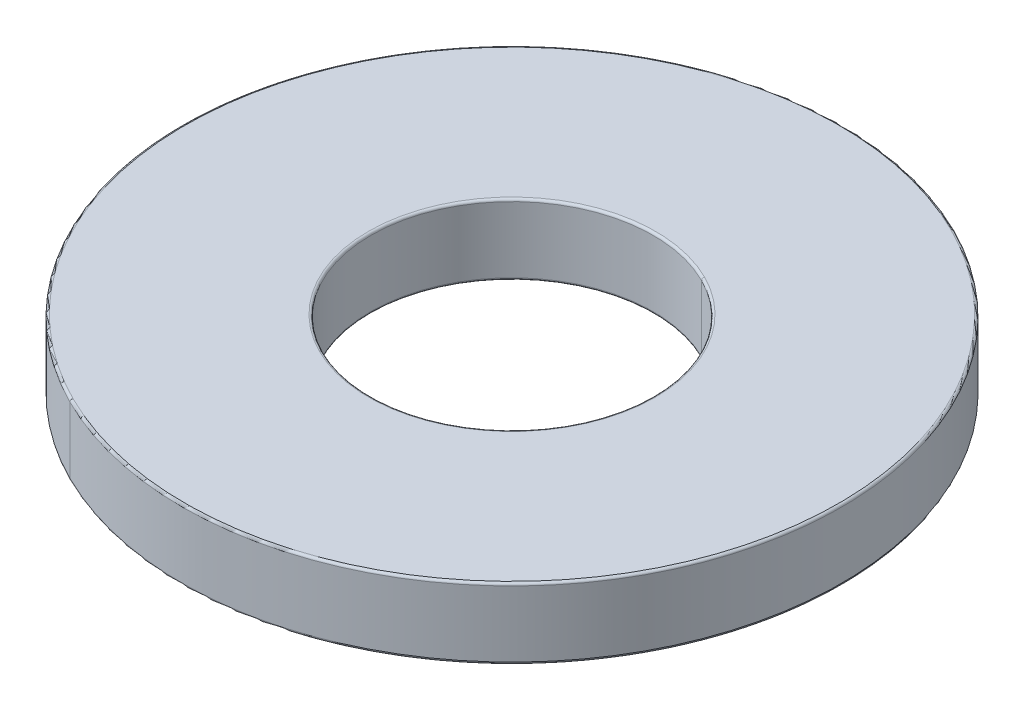
ISO-10303-21;
HEADER;
FILE_DESCRIPTION(('STEP AP214'),'2;1');
FILE_NAME('part.step','',(''),(''),'','','');
FILE_SCHEMA(('AUTOMOTIVE_DESIGN { 1 0 10303 214 1 1 1 1 }'));
ENDSEC;
DATA;
#1=APPLICATION_CONTEXT('core data for automotive mechanical design processes');
#2=APPLICATION_PROTOCOL_DEFINITION('international standard','automotive_design',2000,#1);
#3=PRODUCT_CONTEXT('',#1,'mechanical');
#4=PRODUCT('Part','Part','',(#3));
#5=PRODUCT_RELATED_PRODUCT_CATEGORY('part','',(#4));
#6=PRODUCT_DEFINITION_FORMATION('','',#4);
#7=PRODUCT_DEFINITION_CONTEXT('part definition',#1,'design');
#8=PRODUCT_DEFINITION('design','',#6,#7);
#9=PRODUCT_DEFINITION_SHAPE('','',#8);
#10=(LENGTH_UNIT() NAMED_UNIT(*) SI_UNIT(.MILLI.,.METRE.));
#11=(NAMED_UNIT(*) PLANE_ANGLE_UNIT() SI_UNIT($,.RADIAN.));
#12=(NAMED_UNIT(*) SI_UNIT($,.STERADIAN.) SOLID_ANGLE_UNIT());
#13=UNCERTAINTY_MEASURE_WITH_UNIT(LENGTH_MEASURE(1.E-05),#10,'distance_accuracy_value','');
#14=(GEOMETRIC_REPRESENTATION_CONTEXT(3) GLOBAL_UNCERTAINTY_ASSIGNED_CONTEXT((#13)) GLOBAL_UNIT_ASSIGNED_CONTEXT((#10,
#11,#12)) REPRESENTATION_CONTEXT('',''));
#15=CARTESIAN_POINT('',(0.,0.,0.));
#16=DIRECTION('',(0.,0.,1.));
#17=DIRECTION('',(1.,0.,0.));
#18=AXIS2_PLACEMENT_3D('',#15,#16,#17);
#19=CARTESIAN_POINT('',(-24.601656805203,2.61894104863,11.836193409295));
#20=DIRECTION('',(0.,-1.,0.));
#21=DIRECTION('',(-0.447273631088674,0.,0.894397170686912));
#22=AXIS2_PLACEMENT_3D('',#19,#20,#21);
#23=TOROIDAL_SURFACE('',#22,6.95,0.05);
#24=CARTESIAN_POINT('',(-21.4931050691367,2.61894104863,5.62013307302096));
#25=DIRECTION('',(-0.894397170686912,0.,-0.447273631088674));
#26=DIRECTION('',(0.447273631088674,0.,-0.894397170686912));
#27=AXIS2_PLACEMENT_3D('',#24,#25,#26);
#28=CIRCLE('',#27,0.05);
#29=CARTESIAN_POINT('',(-21.4707413875823,2.61894104863,5.57541321448662));
#30=VERTEX_POINT('',#29);
#31=CARTESIAN_POINT('',(-21.4931050691367,2.56894104863,5.62013307302096));
#32=VERTEX_POINT('',#31);
#33=EDGE_CURVE('E260',#30,#32,#28,.T.);
#34=ORIENTED_EDGE('',*,*,#33,.F.);
#35=CARTESIAN_POINT('',(-24.601656805203,2.61894104863,11.836193409295));
#36=DIRECTION('',(0.,1.,0.));
#37=DIRECTION('',(-0.447273631088674,0.,0.894397170686912));
#38=AXIS2_PLACEMENT_3D('',#35,#36,#37);
#39=CIRCLE('',#38,7.);
#40=CARTESIAN_POINT('',(-27.7325722228237,2.61894104863,18.0969736041034));
#41=VERTEX_POINT('',#40);
#42=EDGE_CURVE('E31',#41,#30,#39,.T.);
#43=ORIENTED_EDGE('',*,*,#42,.F.);
#44=CARTESIAN_POINT('',(-27.7102085412693,2.61894104863,18.052253745569));
#45=DIRECTION('',(0.894397170686912,0.,0.447273631088674));
#46=DIRECTION('',(-0.447273631088674,0.,0.894397170686912));
#47=AXIS2_PLACEMENT_3D('',#44,#45,#46);
#48=CIRCLE('',#47,0.05);
#49=CARTESIAN_POINT('',(-27.7102085412693,2.56894104863,18.052253745569));
#50=VERTEX_POINT('',#49);
#51=EDGE_CURVE('E259',#41,#50,#48,.T.);
#52=ORIENTED_EDGE('',*,*,#51,.T.);
#53=CARTESIAN_POINT('',(-24.601656805203,2.56894104863,11.836193409295));
#54=DIRECTION('',(0.,-1.,0.));
#55=DIRECTION('',(-0.447273631088674,0.,0.894397170686912));
#56=AXIS2_PLACEMENT_3D('',#53,#54,#55);
#57=CIRCLE('',#56,6.95);
#58=EDGE_CURVE('E297',#32,#50,#57,.T.);
#59=ORIENTED_EDGE('',*,*,#58,.F.);
#60=EDGE_LOOP('',(#34,#43,#52,#59));
#61=FACE_BOUND('',#60,.T.);
#62=ADVANCED_FACE('F19',(#61),#23,.T.);
#63=CARTESIAN_POINT('',(-24.601656805203,4.01894104863,11.836193409295));
#64=DIRECTION('',(0.,-1.,0.));
#65=DIRECTION('',(-0.447273631088674,0.,0.894397170686912));
#66=AXIS2_PLACEMENT_3D('',#63,#64,#65);
#67=TOROIDAL_SURFACE('',#66,6.95,0.05);
#68=CARTESIAN_POINT('',(-21.4931050691367,4.01894104863,5.62013307302096));
#69=DIRECTION('',(-0.894397170686912,0.,-0.447273631088674));
#70=DIRECTION('',(0.447273631088674,0.,-0.894397170686912));
#71=AXIS2_PLACEMENT_3D('',#68,#69,#70);
#72=CIRCLE('',#71,0.05);
#73=CARTESIAN_POINT('',(-21.4931050691367,4.06894104863,5.62013307302096));
#74=VERTEX_POINT('',#73);
#75=CARTESIAN_POINT('',(-21.4707413875823,4.01894104863,5.57541321448662));
#76=VERTEX_POINT('',#75);
#77=EDGE_CURVE('E222',#74,#76,#72,.T.);
#78=ORIENTED_EDGE('',*,*,#77,.F.);
#79=CARTESIAN_POINT('',(-24.601656805203,4.06894104863,11.836193409295));
#80=DIRECTION('',(0.,1.,0.));
#81=DIRECTION('',(-0.447273631088674,0.,0.894397170686912));
#82=AXIS2_PLACEMENT_3D('',#79,#80,#81);
#83=CIRCLE('',#82,6.95);
#84=CARTESIAN_POINT('',(-27.7102085412693,4.06894104863,18.052253745569));
#85=VERTEX_POINT('',#84);
#86=EDGE_CURVE('E283',#85,#74,#83,.T.);
#87=ORIENTED_EDGE('',*,*,#86,.F.);
#88=CARTESIAN_POINT('',(-27.7102085412693,4.01894104863,18.052253745569));
#89=DIRECTION('',(0.894397170686912,0.,0.447273631088674));
#90=DIRECTION('',(-0.447273631088674,0.,0.894397170686912));
#91=AXIS2_PLACEMENT_3D('',#88,#89,#90);
#92=CIRCLE('',#91,0.05);
#93=CARTESIAN_POINT('',(-27.7325722228237,4.01894104863,18.0969736041034));
#94=VERTEX_POINT('',#93);
#95=EDGE_CURVE('E252',#85,#94,#92,.T.);
#96=ORIENTED_EDGE('',*,*,#95,.T.);
#97=CARTESIAN_POINT('',(-24.601656805203,4.01894104863,11.836193409295));
#98=DIRECTION('',(0.,-1.,0.));
#99=DIRECTION('',(-0.447273631088674,0.,0.894397170686912));
#100=AXIS2_PLACEMENT_3D('',#97,#98,#99);
#101=CIRCLE('',#100,7.);
#102=EDGE_CURVE('E11',#76,#94,#101,.T.);
#103=ORIENTED_EDGE('',*,*,#102,.F.);
#104=EDGE_LOOP('',(#78,#87,#96,#103));
#105=FACE_BOUND('',#104,.T.);
#106=ADVANCED_FACE('F459',(#105),#67,.T.);
#107=CARTESIAN_POINT('',(-24.601656805203,2.61894104863,11.836193409295));
#108=DIRECTION('',(0.,-1.,0.));
#109=DIRECTION('',(-0.447273631088674,0.,0.894397170686912));
#110=AXIS2_PLACEMENT_3D('',#107,#108,#109);
#111=TOROIDAL_SURFACE('',#110,3.05,0.05);
#112=CARTESIAN_POINT('',(-23.2374722303825,2.61894104863,9.10828203869992));
#113=DIRECTION('',(-0.894397170686912,0.,-0.447273631088674));
#114=DIRECTION('',(0.447273631088674,0.,-0.894397170686912));
#115=AXIS2_PLACEMENT_3D('',#112,#113,#114);
#116=CIRCLE('',#115,0.05);
#117=CARTESIAN_POINT('',(-23.2374722303825,2.56894104863,9.10828203869992));
#118=VERTEX_POINT('',#117);
#119=CARTESIAN_POINT('',(-23.259835911937,2.61894104863,9.15300189723426));
#120=VERTEX_POINT('',#119);
#121=EDGE_CURVE('E251',#118,#120,#116,.T.);
#122=ORIENTED_EDGE('',*,*,#121,.F.);
#123=CARTESIAN_POINT('',(-24.601656805203,2.56894104863,11.836193409295));
#124=DIRECTION('',(0.,1.,0.));
#125=DIRECTION('',(-0.447273631088674,0.,0.894397170686912));
#126=AXIS2_PLACEMENT_3D('',#123,#124,#125);
#127=CIRCLE('',#126,3.05);
#128=CARTESIAN_POINT('',(-25.9658413800235,2.56894104863,14.5641047798901));
#129=VERTEX_POINT('',#128);
#130=EDGE_CURVE('E117',#129,#118,#127,.T.);
#131=ORIENTED_EDGE('',*,*,#130,.F.);
#132=CARTESIAN_POINT('',(-25.9658413800235,2.61894104863,14.5641047798901));
#133=DIRECTION('',(0.894397170686912,0.,0.447273631088674));
#134=DIRECTION('',(-0.447273631088674,0.,0.894397170686912));
#135=AXIS2_PLACEMENT_3D('',#132,#133,#134);
#136=CIRCLE('',#135,0.05);
#137=CARTESIAN_POINT('',(-25.943477698469,2.61894104863,14.5193849213557));
#138=VERTEX_POINT('',#137);
#139=EDGE_CURVE('E325',#129,#138,#136,.T.);
#140=ORIENTED_EDGE('',*,*,#139,.T.);
#141=CARTESIAN_POINT('',(-24.601656805203,2.61894104863,11.836193409295));
#142=DIRECTION('',(0.,-1.,0.));
#143=DIRECTION('',(-0.447273631088674,0.,0.894397170686912));
#144=AXIS2_PLACEMENT_3D('',#141,#142,#143);
#145=CIRCLE('',#144,3.);
#146=EDGE_CURVE('E154',#120,#138,#145,.T.);
#147=ORIENTED_EDGE('',*,*,#146,.F.);
#148=EDGE_LOOP('',(#122,#131,#140,#147));
#149=FACE_BOUND('',#148,.T.);
#150=ADVANCED_FACE('F415',(#149),#111,.T.);
#151=CARTESIAN_POINT('',(-24.601656805203,4.01894104863,11.836193409295));
#152=DIRECTION('',(0.,-1.,0.));
#153=DIRECTION('',(-0.447273631088674,0.,0.894397170686912));
#154=AXIS2_PLACEMENT_3D('',#151,#152,#153);
#155=TOROIDAL_SURFACE('',#154,3.05,0.05);
#156=CARTESIAN_POINT('',(-23.2374722303825,4.01894104863,9.10828203869992));
#157=DIRECTION('',(-0.894397170686912,0.,-0.447273631088674));
#158=DIRECTION('',(0.447273631088674,0.,-0.894397170686912));
#159=AXIS2_PLACEMENT_3D('',#156,#157,#158);
#160=CIRCLE('',#159,0.05);
#161=CARTESIAN_POINT('',(-23.259835911937,4.01894104863,9.15300189723426));
#162=VERTEX_POINT('',#161);
#163=CARTESIAN_POINT('',(-23.2374722303825,4.06894104863,9.10828203869992));
#164=VERTEX_POINT('',#163);
#165=EDGE_CURVE('E253',#162,#164,#160,.T.);
#166=ORIENTED_EDGE('',*,*,#165,.F.);
#167=CARTESIAN_POINT('',(-24.601656805203,4.01894104863,11.836193409295));
#168=DIRECTION('',(0.,1.,0.));
#169=DIRECTION('',(-0.447273631088674,0.,0.894397170686912));
#170=AXIS2_PLACEMENT_3D('',#167,#168,#169);
#171=CIRCLE('',#170,3.);
#172=CARTESIAN_POINT('',(-25.943477698469,4.01894104863,14.5193849213557));
#173=VERTEX_POINT('',#172);
#174=EDGE_CURVE('E228',#173,#162,#171,.T.);
#175=ORIENTED_EDGE('',*,*,#174,.F.);
#176=CARTESIAN_POINT('',(-25.9658413800235,4.01894104863,14.5641047798901));
#177=DIRECTION('',(0.894397170686912,0.,0.447273631088674));
#178=DIRECTION('',(-0.447273631088674,0.,0.894397170686912));
#179=AXIS2_PLACEMENT_3D('',#176,#177,#178);
#180=CIRCLE('',#179,0.05);
#181=CARTESIAN_POINT('',(-25.9658413800235,4.06894104863,14.5641047798901));
#182=VERTEX_POINT('',#181);
#183=EDGE_CURVE('E182',#173,#182,#180,.T.);
#184=ORIENTED_EDGE('',*,*,#183,.T.);
#185=CARTESIAN_POINT('',(-24.601656805203,4.06894104863,11.836193409295));
#186=DIRECTION('',(0.,-1.,0.));
#187=DIRECTION('',(-0.447273631088674,0.,0.894397170686912));
#188=AXIS2_PLACEMENT_3D('',#185,#186,#187);
#189=CIRCLE('',#188,3.05);
#190=EDGE_CURVE('E211',#164,#182,#189,.T.);
#191=ORIENTED_EDGE('',*,*,#190,.F.);
#192=EDGE_LOOP('',(#166,#175,#184,#191));
#193=FACE_BOUND('',#192,.T.);
#194=ADVANCED_FACE('F350',(#193),#155,.T.);
#195=CARTESIAN_POINT('',(-24.601656805203,3.06894104863,11.836193409295));
#196=DIRECTION('',(0.,-1.,0.));
#197=DIRECTION('',(-0.447273631088674,0.,0.894397170686912));
#198=AXIS2_PLACEMENT_3D('',#195,#196,#197);
#199=TOROIDAL_SURFACE('',#198,5.88709701796445,0.5);
#200=CARTESIAN_POINT('',(-21.9685135454067,3.06894104863,6.57079049286824));
#201=DIRECTION('',(-0.894397170686912,0.,-0.447273631088674));
#202=DIRECTION('',(0.447273631088674,0.,-0.894397170686912));
#203=AXIS2_PLACEMENT_3D('',#200,#201,#202);
#204=CIRCLE('',#203,0.5);
#205=CARTESIAN_POINT('',(-21.9685135454067,2.56894104863,6.57079049286824));
#206=VERTEX_POINT('',#205);
#207=CARTESIAN_POINT('',(-22.0889054080105,2.64757606346679,6.81153381821124));
#208=VERTEX_POINT('',#207);
#209=EDGE_CURVE('E160',#206,#208,#204,.T.);
#210=ORIENTED_EDGE('',*,*,#209,.F.);
#211=CARTESIAN_POINT('',(-24.601656805203,2.56894104863,11.836193409295));
#212=DIRECTION('',(0.,1.,0.));
#213=DIRECTION('',(-0.447273631088674,0.,0.894397170686912));
#214=AXIS2_PLACEMENT_3D('',#211,#212,#213);
#215=CIRCLE('',#214,5.88709701796445);
#216=CARTESIAN_POINT('',(-27.2348000649993,2.56894104863,17.1015963257218));
#217=VERTEX_POINT('',#216);
#218=EDGE_CURVE('E23',#217,#206,#215,.T.);
#219=ORIENTED_EDGE('',*,*,#218,.F.);
#220=CARTESIAN_POINT('',(-27.2348000649993,3.06894104863,17.1015963257218));
#221=DIRECTION('',(0.894397170686912,0.,0.447273631088674));
#222=DIRECTION('',(-0.447273631088674,0.,0.894397170686912));
#223=AXIS2_PLACEMENT_3D('',#220,#221,#222);
#224=CIRCLE('',#223,0.5);
#225=CARTESIAN_POINT('',(-27.1144082023955,2.64757606346679,16.8608530003788));
#226=VERTEX_POINT('',#225);
#227=EDGE_CURVE('E163',#217,#226,#224,.T.);
#228=ORIENTED_EDGE('',*,*,#227,.T.);
#229=CARTESIAN_POINT('',(-24.601656805203,2.64757606346679,11.836193409295));
#230=DIRECTION('',(0.,-1.,0.));
#231=DIRECTION('',(-0.447273631088674,0.,0.894397170686912));
#232=AXIS2_PLACEMENT_3D('',#229,#230,#231);
#233=CIRCLE('',#232,5.61792876337559);
#234=EDGE_CURVE('E149',#208,#226,#233,.T.);
#235=ORIENTED_EDGE('',*,*,#234,.F.);
#236=EDGE_LOOP('',(#210,#219,#228,#235));
#237=FACE_BOUND('',#236,.T.);
#238=ADVANCED_FACE('F158',(#237),#199,.T.);
#239=CARTESIAN_POINT('',(-24.601656805203,3.06894104863,11.836193409295));
#240=DIRECTION('',(0.,1.,0.));
#241=DIRECTION('',(0.447273631088674,0.,-0.894397170686912));
#242=AXIS2_PLACEMENT_3D('',#239,#240,#241);
#243=TOROIDAL_SURFACE('',#242,4.07290298203555,0.5);
#244=CARTESIAN_POINT('',(-26.4233589110499,3.06894104863,15.4789863129099));
#245=DIRECTION('',(-0.894397170686912,0.,-0.447273631088674));
#246=DIRECTION('',(0.447273631088674,0.,-0.894397170686912));
#247=AXIS2_PLACEMENT_3D('',#244,#245,#246);
#248=CIRCLE('',#247,0.5);
#249=CARTESIAN_POINT('',(-26.4233589110499,2.56894104863,15.4789863129099));
#250=VERTEX_POINT('',#249);
#251=CARTESIAN_POINT('',(-26.5437507736537,2.64757606346679,15.7197296382529));
#252=VERTEX_POINT('',#251);
#253=EDGE_CURVE('E195',#250,#252,#248,.T.);
#254=ORIENTED_EDGE('',*,*,#253,.F.);
#255=CARTESIAN_POINT('',(-24.601656805203,2.56894104863,11.836193409295));
#256=DIRECTION('',(0.,-1.,0.));
#257=DIRECTION('',(-0.447273631088674,0.,0.894397170686912));
#258=AXIS2_PLACEMENT_3D('',#255,#256,#257);
#259=CIRCLE('',#258,4.07290298203555);
#260=CARTESIAN_POINT('',(-22.7799546993561,2.56894104863,8.19340050568012));
#261=VERTEX_POINT('',#260);
#262=EDGE_CURVE('E319',#261,#250,#259,.T.);
#263=ORIENTED_EDGE('',*,*,#262,.F.);
#264=CARTESIAN_POINT('',(-22.7799546993561,3.06894104863,8.19340050568012));
#265=DIRECTION('',(0.894397170686912,0.,0.447273631088674));
#266=DIRECTION('',(-0.447273631088674,0.,0.894397170686912));
#267=AXIS2_PLACEMENT_3D('',#264,#265,#266);
#268=CIRCLE('',#267,0.5);
#269=CARTESIAN_POINT('',(-22.6595628367523,2.64757606346679,7.95265718033711));
#270=VERTEX_POINT('',#269);
#271=EDGE_CURVE('E167',#261,#270,#268,.T.);
#272=ORIENTED_EDGE('',*,*,#271,.T.);
#273=CARTESIAN_POINT('',(-24.601656805203,2.64757606346679,11.836193409295));
#274=DIRECTION('',(0.,1.,0.));
#275=DIRECTION('',(-0.447273631088674,0.,0.894397170686912));
#276=AXIS2_PLACEMENT_3D('',#273,#274,#275);
#277=CIRCLE('',#276,4.34207123662441);
#278=EDGE_CURVE('E151',#252,#270,#277,.T.);
#279=ORIENTED_EDGE('',*,*,#278,.F.);
#280=EDGE_LOOP('',(#254,#263,#272,#279));
#281=FACE_BOUND('',#280,.T.);
#282=ADVANCED_FACE('F447',(#281),#243,.T.);
#283=CARTESIAN_POINT('',(-24.601656805203,1.64894104863,11.836193409295));
#284=DIRECTION('',(0.,1.,0.));
#285=DIRECTION('',(0.447273631088674,0.,-0.894397170686912));
#286=AXIS2_PLACEMENT_3D('',#283,#284,#285);
#287=TOROIDAL_SURFACE('',#286,4.98,1.185);
#288=CARTESIAN_POINT('',(-26.8290794880246,1.64894104863,16.2902913193158));
#289=DIRECTION('',(-0.894397170686912,0.,-0.447273631088674));
#290=DIRECTION('',(0.447273631088674,0.,-0.894397170686912));
#291=AXIS2_PLACEMENT_3D('',#288,#289,#290);
#292=CIRCLE('',#291,1.185);
#293=EDGE_CURVE('E166',#226,#252,#292,.T.);
#294=ORIENTED_EDGE('',*,*,#293,.F.);
#295=CARTESIAN_POINT('',(-24.601656805203,2.64757606346679,11.836193409295));
#296=DIRECTION('',(0.,-1.,0.));
#297=DIRECTION('',(-0.447273631088674,0.,0.894397170686912));
#298=AXIS2_PLACEMENT_3D('',#295,#296,#297);
#299=CIRCLE('',#298,5.61792876337559);
#300=EDGE_CURVE('E169',#226,#208,#299,.T.);
#301=ORIENTED_EDGE('',*,*,#300,.T.);
#302=CARTESIAN_POINT('',(-22.3742341223814,1.64894104863,7.38209549927418));
#303=DIRECTION('',(0.894397170686912,0.,0.447273631088674));
#304=DIRECTION('',(-0.447273631088674,0.,0.894397170686912));
#305=AXIS2_PLACEMENT_3D('',#302,#303,#304);
#306=CIRCLE('',#305,1.185);
#307=EDGE_CURVE('E46',#208,#270,#306,.T.);
#308=ORIENTED_EDGE('',*,*,#307,.T.);
#309=CARTESIAN_POINT('',(-24.601656805203,2.64757606346679,11.836193409295));
#310=DIRECTION('',(0.,1.,0.));
#311=DIRECTION('',(-0.447273631088674,0.,0.894397170686912));
#312=AXIS2_PLACEMENT_3D('',#309,#310,#311);
#313=CIRCLE('',#312,4.34207123662441);
#314=EDGE_CURVE('E200',#270,#252,#313,.T.);
#315=ORIENTED_EDGE('',*,*,#314,.T.);
#316=EDGE_LOOP('',(#294,#301,#308,#315));
#317=FACE_BOUND('',#316,.T.);
#318=ADVANCED_FACE('F170',(#317),#287,.F.);
#319=CARTESIAN_POINT('',(-24.601656805203,2.56894104863,11.836193409295));
#320=DIRECTION('',(0.,1.,0.));
#321=DIRECTION('',(0.447273631088674,0.,-0.894397170686912));
#322=AXIS2_PLACEMENT_3D('',#319,#320,#321);
#323=CYLINDRICAL_SURFACE('',#322,3.);
#324=DIRECTION('',(0.,1.,0.));
#325=VECTOR('',#324,1.);
#326=CARTESIAN_POINT('',(-25.943477698469,2.56894104863,14.5193849213557));
#327=LINE('',#326,#325);
#328=EDGE_CURVE('E234',#138,#173,#327,.T.);
#329=ORIENTED_EDGE('',*,*,#328,.F.);
#330=CARTESIAN_POINT('',(-24.601656805203,2.61894104863,11.836193409295));
#331=DIRECTION('',(0.,-1.,0.));
#332=DIRECTION('',(-0.447273631088674,0.,0.894397170686912));
#333=AXIS2_PLACEMENT_3D('',#330,#331,#332);
#334=CIRCLE('',#333,3.);
#335=EDGE_CURVE('E329',#138,#120,#334,.T.);
#336=ORIENTED_EDGE('',*,*,#335,.T.);
#337=DIRECTION('',(0.,1.,0.));
#338=VECTOR('',#337,1.);
#339=CARTESIAN_POINT('',(-23.259835911937,2.56894104863,9.15300189723426));
#340=LINE('',#339,#338);
#341=EDGE_CURVE('E233',#120,#162,#340,.T.);
#342=ORIENTED_EDGE('',*,*,#341,.T.);
#343=CARTESIAN_POINT('',(-24.601656805203,4.01894104863,11.836193409295));
#344=DIRECTION('',(0.,1.,0.));
#345=DIRECTION('',(-0.447273631088674,0.,0.894397170686912));
#346=AXIS2_PLACEMENT_3D('',#343,#344,#345);
#347=CIRCLE('',#346,3.);
#348=EDGE_CURVE('E328',#162,#173,#347,.T.);
#349=ORIENTED_EDGE('',*,*,#348,.T.);
#350=EDGE_LOOP('',(#329,#336,#342,#349));
#351=FACE_BOUND('',#350,.T.);
#352=ADVANCED_FACE('F391',(#351),#323,.F.);
#353=CARTESIAN_POINT('',(-24.601656805203,2.56894104863,11.836193409295));
#354=DIRECTION('',(0.,1.,0.));
#355=DIRECTION('',(0.447273631088674,0.,-0.894397170686912));
#356=AXIS2_PLACEMENT_3D('',#353,#354,#355);
#357=CYLINDRICAL_SURFACE('',#356,7.);
#358=DIRECTION('',(0.,1.,0.));
#359=VECTOR('',#358,1.);
#360=CARTESIAN_POINT('',(-27.7325722228237,2.56894104863,18.0969736041034));
#361=LINE('',#360,#359);
#362=EDGE_CURVE('E298',#41,#94,#361,.T.);
#363=ORIENTED_EDGE('',*,*,#362,.F.);
#364=ORIENTED_EDGE('',*,*,#42,.T.);
#365=DIRECTION('',(0.,1.,0.));
#366=VECTOR('',#365,1.);
#367=CARTESIAN_POINT('',(-21.4707413875823,2.56894104863,5.57541321448662));
#368=LINE('',#367,#366);
#369=EDGE_CURVE('E295',#30,#76,#368,.T.);
#370=ORIENTED_EDGE('',*,*,#369,.T.);
#371=ORIENTED_EDGE('',*,*,#102,.T.);
#372=EDGE_LOOP('',(#363,#364,#370,#371));
#373=FACE_BOUND('',#372,.T.);
#374=ADVANCED_FACE('F387',(#373),#357,.T.);
#375=CARTESIAN_POINT('',(-24.601656805203,4.06894104863,11.836193409295));
#376=DIRECTION('',(0.,-1.,0.));
#377=DIRECTION('',(-0.894397170686912,0.,-0.447273631088674));
#378=AXIS2_PLACEMENT_3D('',#375,#376,#377);
#379=PLANE('',#378);
#380=CARTESIAN_POINT('',(-24.601656805203,4.06894104863,11.836193409295));
#381=DIRECTION('',(0.,-1.,0.));
#382=DIRECTION('',(-0.447273631088674,0.,0.894397170686912));
#383=AXIS2_PLACEMENT_3D('',#380,#381,#382);
#384=CIRCLE('',#383,3.05);
#385=EDGE_CURVE('E207',#182,#164,#384,.T.);
#386=ORIENTED_EDGE('',*,*,#385,.T.);
#387=ORIENTED_EDGE('',*,*,#190,.T.);
#388=EDGE_LOOP('',(#386,#387));
#389=FACE_BOUND('',#388,.T.);
#390=ORIENTED_EDGE('',*,*,#86,.T.);
#391=CARTESIAN_POINT('',(-24.601656805203,4.06894104863,11.836193409295));
#392=DIRECTION('',(0.,1.,0.));
#393=DIRECTION('',(-0.447273631088674,0.,0.894397170686912));
#394=AXIS2_PLACEMENT_3D('',#391,#392,#393);
#395=CIRCLE('',#394,6.95);
#396=EDGE_CURVE('E227',#74,#85,#395,.T.);
#397=ORIENTED_EDGE('',*,*,#396,.T.);
#398=EDGE_LOOP('',(#390,#397));
#399=FACE_BOUND('',#398,.T.);
#400=ADVANCED_FACE('F342',(#389,#399),#379,.F.);
#401=CARTESIAN_POINT('',(-24.601656805203,2.56894104863,11.836193409295));
#402=DIRECTION('',(0.,-1.,0.));
#403=DIRECTION('',(-0.894397170686912,0.,-0.447273631088674));
#404=AXIS2_PLACEMENT_3D('',#401,#402,#403);
#405=PLANE('',#404);
#406=ORIENTED_EDGE('',*,*,#130,.T.);
#407=CARTESIAN_POINT('',(-24.601656805203,2.56894104863,11.836193409295));
#408=DIRECTION('',(0.,1.,0.));
#409=DIRECTION('',(-0.447273631088674,0.,0.894397170686912));
#410=AXIS2_PLACEMENT_3D('',#407,#408,#409);
#411=CIRCLE('',#410,3.05);
#412=EDGE_CURVE('E247',#118,#129,#411,.T.);
#413=ORIENTED_EDGE('',*,*,#412,.T.);
#414=EDGE_LOOP('',(#406,#413));
#415=FACE_BOUND('',#414,.T.);
#416=ORIENTED_EDGE('',*,*,#262,.T.);
#417=CARTESIAN_POINT('',(-24.601656805203,2.56894104863,11.836193409295));
#418=DIRECTION('',(0.,-1.,0.));
#419=DIRECTION('',(-0.447273631088674,0.,0.894397170686912));
#420=AXIS2_PLACEMENT_3D('',#417,#418,#419);
#421=CIRCLE('',#420,4.07290298203555);
#422=EDGE_CURVE('E201',#250,#261,#421,.T.);
#423=ORIENTED_EDGE('',*,*,#422,.T.);
#424=EDGE_LOOP('',(#416,#423));
#425=FACE_BOUND('',#424,.T.);
#426=ADVANCED_FACE('F21',(#415,#425),#405,.T.);
#427=CARTESIAN_POINT('',(-24.601656805203,2.56894104863,11.836193409295));
#428=DIRECTION('',(0.,-1.,0.));
#429=DIRECTION('',(-0.894397170686912,0.,-0.447273631088674));
#430=AXIS2_PLACEMENT_3D('',#427,#428,#429);
#431=PLANE('',#430);
#432=ORIENTED_EDGE('',*,*,#218,.T.);
#433=CARTESIAN_POINT('',(-24.601656805203,2.56894104863,11.836193409295));
#434=DIRECTION('',(0.,1.,0.));
#435=DIRECTION('',(-0.447273631088674,0.,0.894397170686912));
#436=AXIS2_PLACEMENT_3D('',#433,#434,#435);
#437=CIRCLE('',#436,5.88709701796445);
#438=EDGE_CURVE('E176',#206,#217,#437,.T.);
#439=ORIENTED_EDGE('',*,*,#438,.T.);
#440=EDGE_LOOP('',(#432,#439));
#441=FACE_BOUND('',#440,.T.);
#442=CARTESIAN_POINT('',(-24.601656805203,2.56894104863,11.836193409295));
#443=DIRECTION('',(0.,-1.,0.));
#444=DIRECTION('',(-0.447273631088674,0.,0.894397170686912));
#445=AXIS2_PLACEMENT_3D('',#442,#443,#444);
#446=CIRCLE('',#445,6.95);
#447=EDGE_CURVE('E255',#50,#32,#446,.T.);
#448=ORIENTED_EDGE('',*,*,#447,.T.);
#449=ORIENTED_EDGE('',*,*,#58,.T.);
#450=EDGE_LOOP('',(#448,#449));
#451=FACE_BOUND('',#450,.T.);
#452=ADVANCED_FACE('F529',(#441,#451),#431,.T.);
#453=CARTESIAN_POINT('',(-24.601656805203,2.56894104863,11.836193409295));
#454=DIRECTION('',(0.,1.,0.));
#455=DIRECTION('',(0.447273631088674,0.,-0.894397170686912));
#456=AXIS2_PLACEMENT_3D('',#453,#454,#455);
#457=CYLINDRICAL_SURFACE('',#456,7.);
#458=CARTESIAN_POINT('',(-24.601656805203,2.61894104863,11.836193409295));
#459=DIRECTION('',(0.,1.,0.));
#460=DIRECTION('',(-0.447273631088674,0.,0.894397170686912));
#461=AXIS2_PLACEMENT_3D('',#458,#459,#460);
#462=CIRCLE('',#461,7.);
#463=EDGE_CURVE('E212',#30,#41,#462,.T.);
#464=ORIENTED_EDGE('',*,*,#463,.T.);
#465=ORIENTED_EDGE('',*,*,#362,.T.);
#466=CARTESIAN_POINT('',(-24.601656805203,4.01894104863,11.836193409295));
#467=DIRECTION('',(0.,-1.,0.));
#468=DIRECTION('',(-0.447273631088674,0.,0.894397170686912));
#469=AXIS2_PLACEMENT_3D('',#466,#467,#468);
#470=CIRCLE('',#469,7.);
#471=EDGE_CURVE('E226',#94,#76,#470,.T.);
#472=ORIENTED_EDGE('',*,*,#471,.T.);
#473=ORIENTED_EDGE('',*,*,#369,.F.);
#474=EDGE_LOOP('',(#464,#465,#472,#473));
#475=FACE_BOUND('',#474,.T.);
#476=ADVANCED_FACE('F434',(#475),#457,.T.);
#477=CARTESIAN_POINT('',(-24.601656805203,2.56894104863,11.836193409295));
#478=DIRECTION('',(0.,1.,0.));
#479=DIRECTION('',(0.447273631088674,0.,-0.894397170686912));
#480=AXIS2_PLACEMENT_3D('',#477,#478,#479);
#481=CYLINDRICAL_SURFACE('',#480,3.);
#482=ORIENTED_EDGE('',*,*,#146,.T.);
#483=ORIENTED_EDGE('',*,*,#328,.T.);
#484=ORIENTED_EDGE('',*,*,#174,.T.);
#485=ORIENTED_EDGE('',*,*,#341,.F.);
#486=EDGE_LOOP('',(#482,#483,#484,#485));
#487=FACE_BOUND('',#486,.T.);
#488=ADVANCED_FACE('F430',(#487),#481,.F.);
#489=CARTESIAN_POINT('',(-24.601656805203,1.64894104863,11.836193409295));
#490=DIRECTION('',(0.,1.,0.));
#491=DIRECTION('',(0.447273631088674,0.,-0.894397170686912));
#492=AXIS2_PLACEMENT_3D('',#489,#490,#491);
#493=TOROIDAL_SURFACE('',#492,4.98,1.185);
#494=ORIENTED_EDGE('',*,*,#234,.T.);
#495=ORIENTED_EDGE('',*,*,#293,.T.);
#496=ORIENTED_EDGE('',*,*,#278,.T.);
#497=ORIENTED_EDGE('',*,*,#307,.F.);
#498=EDGE_LOOP('',(#494,#495,#496,#497));
#499=FACE_BOUND('',#498,.T.);
#500=ADVANCED_FACE('F147',(#499),#493,.F.);
#501=CARTESIAN_POINT('',(-24.601656805203,3.06894104863,11.836193409295));
#502=DIRECTION('',(0.,1.,0.));
#503=DIRECTION('',(0.447273631088674,0.,-0.894397170686912));
#504=AXIS2_PLACEMENT_3D('',#501,#502,#503);
#505=TOROIDAL_SURFACE('',#504,4.07290298203555,0.5);
#506=ORIENTED_EDGE('',*,*,#422,.F.);
#507=ORIENTED_EDGE('',*,*,#253,.T.);
#508=ORIENTED_EDGE('',*,*,#314,.F.);
#509=ORIENTED_EDGE('',*,*,#271,.F.);
#510=EDGE_LOOP('',(#506,#507,#508,#509));
#511=FACE_BOUND('',#510,.T.);
#512=ADVANCED_FACE('F399',(#511),#505,.T.);
#513=CARTESIAN_POINT('',(-24.601656805203,3.06894104863,11.836193409295));
#514=DIRECTION('',(0.,-1.,0.));
#515=DIRECTION('',(-0.447273631088674,0.,0.894397170686912));
#516=AXIS2_PLACEMENT_3D('',#513,#514,#515);
#517=TOROIDAL_SURFACE('',#516,5.88709701796445,0.5);
#518=ORIENTED_EDGE('',*,*,#438,.F.);
#519=ORIENTED_EDGE('',*,*,#209,.T.);
#520=ORIENTED_EDGE('',*,*,#300,.F.);
#521=ORIENTED_EDGE('',*,*,#227,.F.);
#522=EDGE_LOOP('',(#518,#519,#520,#521));
#523=FACE_BOUND('',#522,.T.);
#524=ADVANCED_FACE('F174',(#523),#517,.T.);
#525=CARTESIAN_POINT('',(-24.601656805203,4.01894104863,11.836193409295));
#526=DIRECTION('',(0.,-1.,0.));
#527=DIRECTION('',(-0.447273631088674,0.,0.894397170686912));
#528=AXIS2_PLACEMENT_3D('',#525,#526,#527);
#529=TOROIDAL_SURFACE('',#528,3.05,0.05);
#530=ORIENTED_EDGE('',*,*,#348,.F.);
#531=ORIENTED_EDGE('',*,*,#165,.T.);
#532=ORIENTED_EDGE('',*,*,#385,.F.);
#533=ORIENTED_EDGE('',*,*,#183,.F.);
#534=EDGE_LOOP('',(#530,#531,#532,#533));
#535=FACE_BOUND('',#534,.T.);
#536=ADVANCED_FACE('F353',(#535),#529,.T.);
#537=CARTESIAN_POINT('',(-24.601656805203,2.61894104863,11.836193409295));
#538=DIRECTION('',(0.,-1.,0.));
#539=DIRECTION('',(-0.447273631088674,0.,0.894397170686912));
#540=AXIS2_PLACEMENT_3D('',#537,#538,#539);
#541=TOROIDAL_SURFACE('',#540,3.05,0.05);
#542=ORIENTED_EDGE('',*,*,#412,.F.);
#543=ORIENTED_EDGE('',*,*,#121,.T.);
#544=ORIENTED_EDGE('',*,*,#335,.F.);
#545=ORIENTED_EDGE('',*,*,#139,.F.);
#546=EDGE_LOOP('',(#542,#543,#544,#545));
#547=FACE_BOUND('',#546,.T.);
#548=ADVANCED_FACE('F420',(#547),#541,.T.);
#549=CARTESIAN_POINT('',(-24.601656805203,4.01894104863,11.836193409295));
#550=DIRECTION('',(0.,-1.,0.));
#551=DIRECTION('',(-0.447273631088674,0.,0.894397170686912));
#552=AXIS2_PLACEMENT_3D('',#549,#550,#551);
#553=TOROIDAL_SURFACE('',#552,6.95,0.05);
#554=ORIENTED_EDGE('',*,*,#396,.F.);
#555=ORIENTED_EDGE('',*,*,#77,.T.);
#556=ORIENTED_EDGE('',*,*,#471,.F.);
#557=ORIENTED_EDGE('',*,*,#95,.F.);
#558=EDGE_LOOP('',(#554,#555,#556,#557));
#559=FACE_BOUND('',#558,.T.);
#560=ADVANCED_FACE('F424',(#559),#553,.T.);
#561=CARTESIAN_POINT('',(-24.601656805203,2.61894104863,11.836193409295));
#562=DIRECTION('',(0.,-1.,0.));
#563=DIRECTION('',(-0.447273631088674,0.,0.894397170686912));
#564=AXIS2_PLACEMENT_3D('',#561,#562,#563);
#565=TOROIDAL_SURFACE('',#564,6.95,0.05);
#566=ORIENTED_EDGE('',*,*,#463,.F.);
#567=ORIENTED_EDGE('',*,*,#33,.T.);
#568=ORIENTED_EDGE('',*,*,#447,.F.);
#569=ORIENTED_EDGE('',*,*,#51,.F.);
#570=EDGE_LOOP('',(#566,#567,#568,#569));
#571=FACE_BOUND('',#570,.T.);
#572=ADVANCED_FACE('F468',(#571),#565,.T.);
#573=CLOSED_SHELL('',(#62,#106,#150,#194,#238,#282,#318,#352,#374,#400,#426,#452,#476,#488,#500,
#512,#524,#536,#548,#560,#572));
#574=MANIFOLD_SOLID_BREP('B1',#573);
#575=ADVANCED_BREP_SHAPE_REPRESENTATION('',(#18,#574),#14);
#576=SHAPE_DEFINITION_REPRESENTATION(#9,#575);
ENDSEC;
END-ISO-10303-21;
